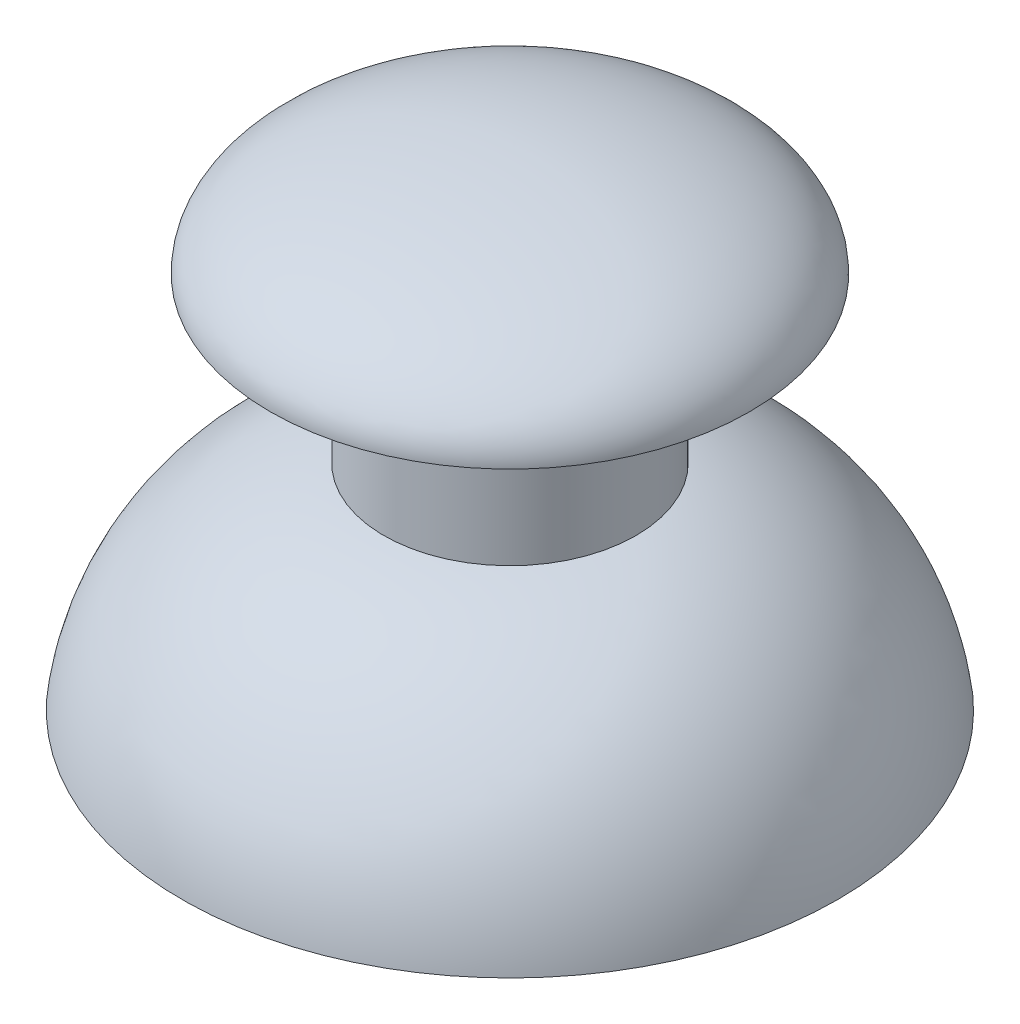
ISO-10303-21;
HEADER;
FILE_DESCRIPTION(('STEP AP214'),'2;1');
FILE_NAME('part.step','',(''),(''),'','','');
FILE_SCHEMA(('AUTOMOTIVE_DESIGN { 1 0 10303 214 1 1 1 1 }'));
ENDSEC;
DATA;
#1=APPLICATION_CONTEXT('core data for automotive mechanical design processes');
#2=APPLICATION_PROTOCOL_DEFINITION('international standard','automotive_design',2000,#1);
#3=PRODUCT_CONTEXT('',#1,'mechanical');
#4=PRODUCT('Part','Part','',(#3));
#5=PRODUCT_RELATED_PRODUCT_CATEGORY('part','',(#4));
#6=PRODUCT_DEFINITION_FORMATION('','',#4);
#7=PRODUCT_DEFINITION_CONTEXT('part definition',#1,'design');
#8=PRODUCT_DEFINITION('design','',#6,#7);
#9=PRODUCT_DEFINITION_SHAPE('','',#8);
#10=(LENGTH_UNIT() NAMED_UNIT(*) SI_UNIT(.MILLI.,.METRE.));
#11=(NAMED_UNIT(*) PLANE_ANGLE_UNIT() SI_UNIT($,.RADIAN.));
#12=(NAMED_UNIT(*) SI_UNIT($,.STERADIAN.) SOLID_ANGLE_UNIT());
#13=UNCERTAINTY_MEASURE_WITH_UNIT(LENGTH_MEASURE(1.E-05),#10,'distance_accuracy_value','');
#14=(GEOMETRIC_REPRESENTATION_CONTEXT(3) GLOBAL_UNCERTAINTY_ASSIGNED_CONTEXT((#13)) GLOBAL_UNIT_ASSIGNED_CONTEXT((#10,
#11,#12)) REPRESENTATION_CONTEXT('',''));
#15=CARTESIAN_POINT('',(0.,0.,0.));
#16=DIRECTION('',(0.,0.,1.));
#17=DIRECTION('',(1.,0.,0.));
#18=AXIS2_PLACEMENT_3D('',#15,#16,#17);
#19=CARTESIAN_POINT('',(0.,15.,0.));
#20=DIRECTION('',(0.,0.,1.));
#21=DIRECTION('',(-1.,0.,0.));
#22=AXIS2_PLACEMENT_3D('',#19,#20,#21);
#23=ELLIPSE('',#22,9.5,4.);
#24=TRIMMED_CURVE('',#23,(PARAMETER_VALUE(1.5707963267949)),(PARAMETER_VALUE(4.71238898038469)),
.T.,.PARAMETER.);
#25=CARTESIAN_POINT('',(0.,0.,0.));
#26=DIRECTION('',(0.,-1.,0.));
#27=AXIS1_PLACEMENT('',#25,#26);
#28=SURFACE_OF_REVOLUTION('',#24,#27);
#29=CARTESIAN_POINT('',(0.,19.,0.));
#30=VERTEX_POINT('',#29);
#31=VERTEX_LOOP('',#30);
#32=FACE_BOUND('',#31,.T.);
#33=CARTESIAN_POINT('',(0.,15.,0.));
#34=DIRECTION('',(0.,-1.,0.));
#35=DIRECTION('',(1.,0.,0.));
#36=AXIS2_PLACEMENT_3D('',#33,#34,#35);
#37=CIRCLE('',#36,9.49999999999999);
#38=CARTESIAN_POINT('',(9.5,15.,0.));
#39=VERTEX_POINT('',#38);
#40=EDGE_CURVE('E51',#39,#39,#37,.T.);
#41=ORIENTED_EDGE('',*,*,#40,.F.);
#42=EDGE_LOOP('',(#41));
#43=FACE_BOUND('',#42,.T.);
#44=ADVANCED_FACE('F36',(#32,#43),#28,.F.);
#45=CARTESIAN_POINT('',(0.,8.5,0.));
#46=DIRECTION('',(0.,-1.,0.));
#47=DIRECTION('',(1.,0.,0.));
#48=AXIS2_PLACEMENT_3D('',#45,#46,#47);
#49=PLANE('',#48);
#50=CARTESIAN_POINT('',(0.,8.5,0.));
#51=DIRECTION('',(0.,-1.,0.));
#52=DIRECTION('',(1.,0.,0.));
#53=AXIS2_PLACEMENT_3D('',#50,#51,#52);
#54=CIRCLE('',#53,0.999999999999997);
#55=CARTESIAN_POINT('',(0.999999999999998,8.5,0.));
#56=VERTEX_POINT('',#55);
#57=EDGE_CURVE('E11',#56,#56,#54,.T.);
#58=ORIENTED_EDGE('',*,*,#57,.T.);
#59=EDGE_LOOP('',(#58));
#60=FACE_BOUND('',#59,.T.);
#61=ADVANCED_FACE('F48',(#60),#49,.T.);
#62=CARTESIAN_POINT('',(0.,0.,0.));
#63=DIRECTION('',(0.,-1.,0.));
#64=DIRECTION('',(1.,0.,0.));
#65=AXIS2_PLACEMENT_3D('',#62,#63,#64);
#66=CYLINDRICAL_SURFACE('',#65,0.999999999999998);
#67=CARTESIAN_POINT('',(0.,3.,0.));
#68=DIRECTION('',(0.,-1.,0.));
#69=DIRECTION('',(1.,0.,0.));
#70=AXIS2_PLACEMENT_3D('',#67,#68,#69);
#71=CIRCLE('',#70,0.999999999999999);
#72=CARTESIAN_POINT('',(1.,3.,0.));
#73=VERTEX_POINT('',#72);
#74=EDGE_CURVE('E43',#73,#73,#71,.T.);
#75=ORIENTED_EDGE('',*,*,#74,.T.);
#76=EDGE_LOOP('',(#75));
#77=FACE_BOUND('',#76,.T.);
#78=ORIENTED_EDGE('',*,*,#57,.F.);
#79=EDGE_LOOP('',(#78));
#80=FACE_BOUND('',#79,.T.);
#81=ADVANCED_FACE('F82',(#77,#80),#66,.F.);
#82=CARTESIAN_POINT('',(1.,3.,0.));
#83=DIRECTION('',(0.,-1.,0.));
#84=DIRECTION('',(1.,0.,0.));
#85=AXIS2_PLACEMENT_3D('',#82,#83,#84);
#86=PLANE('',#85);
#87=CARTESIAN_POINT('',(0.,3.,0.));
#88=DIRECTION('',(0.,-1.,0.));
#89=DIRECTION('',(1.,0.,0.));
#90=AXIS2_PLACEMENT_3D('',#87,#88,#89);
#91=CIRCLE('',#90,3.);
#92=CARTESIAN_POINT('',(3.,3.,0.));
#93=VERTEX_POINT('',#92);
#94=EDGE_CURVE('E77',#93,#93,#91,.T.);
#95=ORIENTED_EDGE('',*,*,#94,.T.);
#96=EDGE_LOOP('',(#95));
#97=FACE_BOUND('',#96,.T.);
#98=ORIENTED_EDGE('',*,*,#74,.F.);
#99=EDGE_LOOP('',(#98));
#100=FACE_BOUND('',#99,.T.);
#101=ADVANCED_FACE('F85',(#97,#100),#86,.T.);
#102=CARTESIAN_POINT('',(0.,0.,0.));
#103=DIRECTION('',(0.,-1.,0.));
#104=DIRECTION('',(1.,0.,0.));
#105=AXIS2_PLACEMENT_3D('',#102,#103,#104);
#106=CYLINDRICAL_SURFACE('',#105,3.);
#107=CARTESIAN_POINT('',(0.,14.,0.));
#108=DIRECTION('',(0.,-1.,0.));
#109=DIRECTION('',(1.,0.,0.));
#110=AXIS2_PLACEMENT_3D('',#107,#108,#109);
#111=CIRCLE('',#110,2.99999999999999);
#112=CARTESIAN_POINT('',(3.,14.,0.));
#113=VERTEX_POINT('',#112);
#114=EDGE_CURVE('E74',#113,#113,#111,.T.);
#115=ORIENTED_EDGE('',*,*,#114,.T.);
#116=EDGE_LOOP('',(#115));
#117=FACE_BOUND('',#116,.T.);
#118=ORIENTED_EDGE('',*,*,#94,.F.);
#119=EDGE_LOOP('',(#118));
#120=FACE_BOUND('',#119,.T.);
#121=ADVANCED_FACE('F87',(#117,#120),#106,.T.);
#122=CARTESIAN_POINT('',(3.,14.,0.));
#123=DIRECTION('',(0.,-1.,0.));
#124=DIRECTION('',(1.,0.,0.));
#125=AXIS2_PLACEMENT_3D('',#122,#123,#124);
#126=PLANE('',#125);
#127=CARTESIAN_POINT('',(0.,14.,0.));
#128=DIRECTION('',(0.,-1.,0.));
#129=DIRECTION('',(1.,0.,0.));
#130=AXIS2_PLACEMENT_3D('',#127,#128,#129);
#131=CIRCLE('',#130,3.99999999999999);
#132=CARTESIAN_POINT('',(4.,14.,0.));
#133=VERTEX_POINT('',#132);
#134=EDGE_CURVE('E71',#133,#133,#131,.T.);
#135=ORIENTED_EDGE('',*,*,#134,.T.);
#136=EDGE_LOOP('',(#135));
#137=FACE_BOUND('',#136,.T.);
#138=ORIENTED_EDGE('',*,*,#114,.F.);
#139=EDGE_LOOP('',(#138));
#140=FACE_BOUND('',#139,.T.);
#141=ADVANCED_FACE('F94',(#137,#140),#126,.T.);
#142=CARTESIAN_POINT('',(0.,0.,0.));
#143=DIRECTION('',(0.,-1.,0.));
#144=DIRECTION('',(1.,0.,0.));
#145=AXIS2_PLACEMENT_3D('',#142,#143,#144);
#146=CYLINDRICAL_SURFACE('',#145,4.);
#147=CARTESIAN_POINT('',(0.,7.63826613312956,0.));
#148=DIRECTION('',(0.,-1.,0.));
#149=DIRECTION('',(1.,0.,0.));
#150=AXIS2_PLACEMENT_3D('',#147,#148,#149);
#151=CIRCLE('',#150,4.);
#152=CARTESIAN_POINT('',(4.,7.63826613312956,0.));
#153=VERTEX_POINT('',#152);
#154=EDGE_CURVE('E68',#153,#153,#151,.T.);
#155=ORIENTED_EDGE('',*,*,#154,.T.);
#156=EDGE_LOOP('',(#155));
#157=FACE_BOUND('',#156,.T.);
#158=ORIENTED_EDGE('',*,*,#134,.F.);
#159=EDGE_LOOP('',(#158));
#160=FACE_BOUND('',#159,.T.);
#161=ADVANCED_FACE('F130',(#157,#160),#146,.F.);
#162=CARTESIAN_POINT('',(0.,-1.31529218138816,0.));
#163=DIRECTION('',(0.,-1.,0.));
#164=DIRECTION('',(1.,0.,0.));
#165=AXIS2_PLACEMENT_3D('',#162,#163,#164);
#166=DEGENERATE_TOROIDAL_SURFACE('',#165,3.08687705727508,9.,.T.);
#167=CARTESIAN_POINT('',(0.,0.0320265790328077,0.));
#168=DIRECTION('',(0.,-1.,0.));
#169=DIRECTION('',(1.,0.,0.));
#170=AXIS2_PLACEMENT_3D('',#167,#168,#169);
#171=CIRCLE('',#170,11.9854574023536);
#172=CARTESIAN_POINT('',(11.9854574023536,0.032026579032806,0.));
#173=VERTEX_POINT('',#172);
#174=EDGE_CURVE('E65',#173,#173,#171,.T.);
#175=ORIENTED_EDGE('',*,*,#174,.T.);
#176=EDGE_LOOP('',(#175));
#177=FACE_BOUND('',#176,.T.);
#178=ORIENTED_EDGE('',*,*,#154,.F.);
#179=EDGE_LOOP('',(#178));
#180=FACE_BOUND('',#179,.T.);
#181=ADVANCED_FACE('F139',(#177,#180),#166,.F.);
#182=CARTESIAN_POINT('',(0.,0.0320265790328077,0.));
#183=DIRECTION('',(0.,-1.,0.));
#184=DIRECTION('',(1.,0.,0.));
#185=AXIS2_PLACEMENT_3D('',#182,#183,#184);
#186=CONICAL_SURFACE('',#185,11.9854574023536,1.53923930077926);
#187=CARTESIAN_POINT('',(0.,0.,0.));
#188=DIRECTION('',(0.,-1.,0.));
#189=DIRECTION('',(1.,0.,0.));
#190=AXIS2_PLACEMENT_3D('',#187,#188,#189);
#191=CIRCLE('',#190,13.);
#192=CARTESIAN_POINT('',(13.,0.,0.));
#193=VERTEX_POINT('',#192);
#194=EDGE_CURVE('E62',#193,#193,#191,.T.);
#195=ORIENTED_EDGE('',*,*,#194,.T.);
#196=EDGE_LOOP('',(#195));
#197=FACE_BOUND('',#196,.T.);
#198=ORIENTED_EDGE('',*,*,#174,.F.);
#199=EDGE_LOOP('',(#198));
#200=FACE_BOUND('',#199,.T.);
#201=ADVANCED_FACE('F149',(#197,#200),#186,.F.);
#202=CARTESIAN_POINT('',(0.,-1.31529218138816,0.));
#203=DIRECTION('',(0.,-1.,0.));
#204=DIRECTION('',(1.,0.,0.));
#205=AXIS2_PLACEMENT_3D('',#202,#203,#204);
#206=DEGENERATE_TOROIDAL_SURFACE('',#205,3.08687705727508,10.,.T.);
#207=CARTESIAN_POINT('',(0.,8.5,0.));
#208=DIRECTION('',(0.,-1.,0.));
#209=DIRECTION('',(1.,0.,0.));
#210=AXIS2_PLACEMENT_3D('',#207,#208,#209);
#211=CIRCLE('',#210,5.);
#212=CARTESIAN_POINT('',(5.,8.5,0.));
#213=VERTEX_POINT('',#212);
#214=EDGE_CURVE('E56',#213,#213,#211,.T.);
#215=ORIENTED_EDGE('',*,*,#214,.T.);
#216=EDGE_LOOP('',(#215));
#217=FACE_BOUND('',#216,.T.);
#218=ORIENTED_EDGE('',*,*,#194,.F.);
#219=EDGE_LOOP('',(#218));
#220=FACE_BOUND('',#219,.T.);
#221=ADVANCED_FACE('F159',(#217,#220),#206,.T.);
#222=CARTESIAN_POINT('',(0.,0.,0.));
#223=DIRECTION('',(0.,-1.,0.));
#224=DIRECTION('',(1.,0.,0.));
#225=AXIS2_PLACEMENT_3D('',#222,#223,#224);
#226=CYLINDRICAL_SURFACE('',#225,5.);
#227=CARTESIAN_POINT('',(0.,14.,0.));
#228=DIRECTION('',(0.,-1.,0.));
#229=DIRECTION('',(1.,0.,0.));
#230=AXIS2_PLACEMENT_3D('',#227,#228,#229);
#231=CIRCLE('',#230,4.99999999999999);
#232=CARTESIAN_POINT('',(5.,14.,0.));
#233=VERTEX_POINT('',#232);
#234=EDGE_CURVE('E53',#233,#233,#231,.T.);
#235=ORIENTED_EDGE('',*,*,#234,.T.);
#236=EDGE_LOOP('',(#235));
#237=FACE_BOUND('',#236,.T.);
#238=ORIENTED_EDGE('',*,*,#214,.F.);
#239=EDGE_LOOP('',(#238));
#240=FACE_BOUND('',#239,.T.);
#241=ADVANCED_FACE('F169',(#237,#240),#226,.T.);
#242=CARTESIAN_POINT('',(0.,14.,0.));
#243=DIRECTION('',(0.,1.,0.));
#244=DIRECTION('',(-1.,0.,0.));
#245=AXIS2_PLACEMENT_3D('',#242,#243,#244);
#246=CONICAL_SURFACE('',#245,4.99999999999999,1.35212738092095);
#247=ORIENTED_EDGE('',*,*,#40,.T.);
#248=EDGE_LOOP('',(#247));
#249=FACE_BOUND('',#248,.T.);
#250=ORIENTED_EDGE('',*,*,#234,.F.);
#251=EDGE_LOOP('',(#250));
#252=FACE_BOUND('',#251,.T.);
#253=ADVANCED_FACE('F179',(#249,#252),#246,.T.);
#254=CLOSED_SHELL('',(#44,#61,#81,#101,#121,#141,#161,#181,#201,#221,#241,#253));
#255=MANIFOLD_SOLID_BREP('B2',#254);
#256=ADVANCED_BREP_SHAPE_REPRESENTATION('',(#18,#255),#14);
#257=SHAPE_DEFINITION_REPRESENTATION(#9,#256);
ENDSEC;
END-ISO-10303-21;
